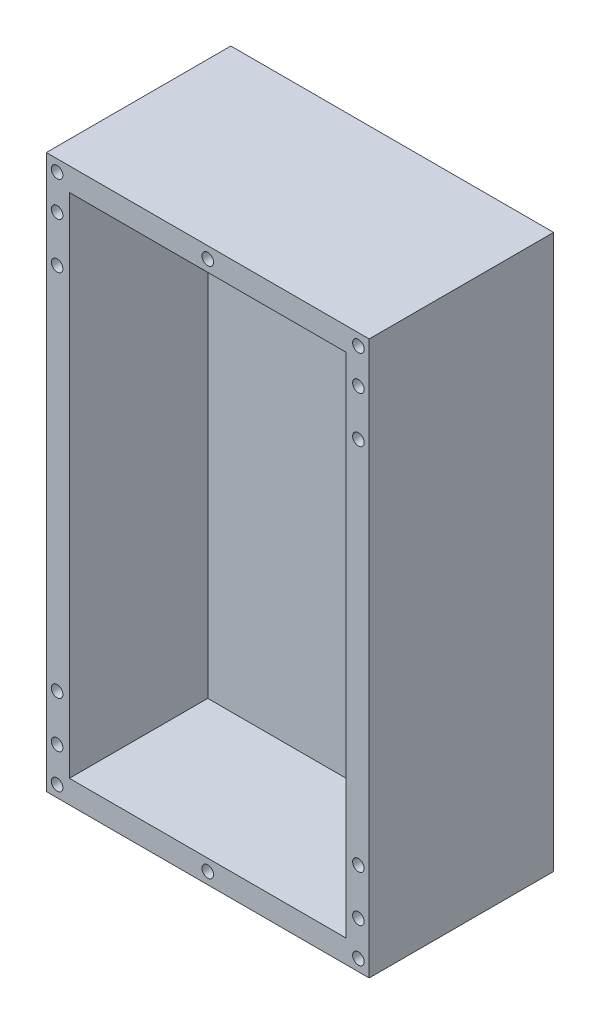
ISO-10303-21;
HEADER;
FILE_DESCRIPTION(('STEP AP214'),'2;1');
FILE_NAME('part.step','',(''),(''),'','','');
FILE_SCHEMA(('AUTOMOTIVE_DESIGN { 1 0 10303 214 1 1 1 1 }'));
ENDSEC;
DATA;
#1=APPLICATION_CONTEXT('core data for automotive mechanical design processes');
#2=APPLICATION_PROTOCOL_DEFINITION('international standard','automotive_design',2000,#1);
#3=PRODUCT_CONTEXT('',#1,'mechanical');
#4=PRODUCT('Part','Part','',(#3));
#5=PRODUCT_RELATED_PRODUCT_CATEGORY('part','',(#4));
#6=PRODUCT_DEFINITION_FORMATION('','',#4);
#7=PRODUCT_DEFINITION_CONTEXT('part definition',#1,'design');
#8=PRODUCT_DEFINITION('design','',#6,#7);
#9=PRODUCT_DEFINITION_SHAPE('','',#8);
#10=(LENGTH_UNIT() NAMED_UNIT(*) SI_UNIT(.MILLI.,.METRE.));
#11=(NAMED_UNIT(*) PLANE_ANGLE_UNIT() SI_UNIT($,.RADIAN.));
#12=(NAMED_UNIT(*) SI_UNIT($,.STERADIAN.) SOLID_ANGLE_UNIT());
#13=UNCERTAINTY_MEASURE_WITH_UNIT(LENGTH_MEASURE(1.E-05),#10,'distance_accuracy_value','');
#14=(GEOMETRIC_REPRESENTATION_CONTEXT(3) GLOBAL_UNCERTAINTY_ASSIGNED_CONTEXT((#13)) GLOBAL_UNIT_ASSIGNED_CONTEXT((#10,
#11,#12)) REPRESENTATION_CONTEXT('',''));
#15=CARTESIAN_POINT('',(0.,0.,0.));
#16=DIRECTION('',(0.,0.,1.));
#17=DIRECTION('',(1.,0.,0.));
#18=AXIS2_PLACEMENT_3D('',#15,#16,#17);
#19=CARTESIAN_POINT('',(25.4,584.2,203.2));
#20=DIRECTION('',(1.,0.,0.));
#21=DIRECTION('',(0.,1.,0.));
#22=AXIS2_PLACEMENT_3D('',#19,#20,#21);
#23=PLANE('',#22);
#24=DIRECTION('',(0.,0.,-1.));
#25=VECTOR('',#24,1.);
#26=CARTESIAN_POINT('',(25.4,25.4000000000001,203.2));
#27=LINE('',#26,#25);
#28=CARTESIAN_POINT('',(25.4,25.4000000000001,203.2));
#29=VERTEX_POINT('',#28);
#30=CARTESIAN_POINT('',(25.4,25.4000000000001,50.8));
#31=VERTEX_POINT('',#30);
#32=EDGE_CURVE('E114',#29,#31,#27,.T.);
#33=ORIENTED_EDGE('',*,*,#32,.T.);
#34=DIRECTION('',(0.,1.,0.));
#35=VECTOR('',#34,1.);
#36=CARTESIAN_POINT('',(25.4,584.2,50.8));
#37=LINE('',#36,#35);
#38=CARTESIAN_POINT('',(25.4,584.2,50.8));
#39=VERTEX_POINT('',#38);
#40=EDGE_CURVE('E98',#31,#39,#37,.T.);
#41=ORIENTED_EDGE('',*,*,#40,.T.);
#42=DIRECTION('',(0.,0.,-1.));
#43=VECTOR('',#42,1.);
#44=CARTESIAN_POINT('',(25.4,584.2,203.2));
#45=LINE('',#44,#43);
#46=CARTESIAN_POINT('',(25.4,584.2,203.2));
#47=VERTEX_POINT('',#46);
#48=EDGE_CURVE('E118',#47,#39,#45,.T.);
#49=ORIENTED_EDGE('',*,*,#48,.F.);
#50=DIRECTION('',(0.,-1.,0.));
#51=VECTOR('',#50,1.);
#52=CARTESIAN_POINT('',(25.4,584.2,203.2));
#53=LINE('',#52,#51);
#54=EDGE_CURVE('E623',#47,#29,#53,.T.);
#55=ORIENTED_EDGE('',*,*,#54,.T.);
#56=EDGE_LOOP('',(#33,#41,#49,#55));
#57=FACE_BOUND('',#56,.T.);
#58=ADVANCED_FACE('F32',(#57),#23,.T.);
#59=CARTESIAN_POINT('',(25.4,25.4000000000001,203.2));
#60=DIRECTION('',(0.,1.,0.));
#61=DIRECTION('',(0.,0.,1.));
#62=AXIS2_PLACEMENT_3D('',#59,#60,#61);
#63=PLANE('',#62);
#64=DIRECTION('',(0.,0.,-1.));
#65=VECTOR('',#64,1.);
#66=CARTESIAN_POINT('',(330.2,25.4000000000001,203.2));
#67=LINE('',#66,#65);
#68=CARTESIAN_POINT('',(330.2,25.4000000000001,203.2));
#69=VERTEX_POINT('',#68);
#70=CARTESIAN_POINT('',(330.2,25.4000000000001,50.8));
#71=VERTEX_POINT('',#70);
#72=EDGE_CURVE('E107',#69,#71,#67,.T.);
#73=ORIENTED_EDGE('',*,*,#72,.T.);
#74=DIRECTION('',(-1.,0.,0.));
#75=VECTOR('',#74,1.);
#76=CARTESIAN_POINT('',(330.2,25.4000000000001,50.8));
#77=LINE('',#76,#75);
#78=EDGE_CURVE('E95',#71,#31,#77,.T.);
#79=ORIENTED_EDGE('',*,*,#78,.T.);
#80=ORIENTED_EDGE('',*,*,#32,.F.);
#81=DIRECTION('',(1.,0.,0.));
#82=VECTOR('',#81,1.);
#83=CARTESIAN_POINT('',(25.4,25.4000000000001,203.2));
#84=LINE('',#83,#82);
#85=EDGE_CURVE('E113',#29,#69,#84,.T.);
#86=ORIENTED_EDGE('',*,*,#85,.T.);
#87=EDGE_LOOP('',(#73,#79,#80,#86));
#88=FACE_BOUND('',#87,.T.);
#89=ADVANCED_FACE('F111',(#88),#63,.T.);
#90=CARTESIAN_POINT('',(330.2,584.2,203.2));
#91=DIRECTION('',(-1.,0.,0.));
#92=DIRECTION('',(0.,-1.,0.));
#93=AXIS2_PLACEMENT_3D('',#90,#91,#92);
#94=PLANE('',#93);
#95=DIRECTION('',(0.,0.,-1.));
#96=VECTOR('',#95,1.);
#97=CARTESIAN_POINT('',(330.2,584.2,203.2));
#98=LINE('',#97,#96);
#99=CARTESIAN_POINT('',(330.2,584.2,203.2));
#100=VERTEX_POINT('',#99);
#101=CARTESIAN_POINT('',(330.2,584.2,50.8));
#102=VERTEX_POINT('',#101);
#103=EDGE_CURVE('E54',#100,#102,#98,.T.);
#104=ORIENTED_EDGE('',*,*,#103,.T.);
#105=DIRECTION('',(0.,-1.,0.));
#106=VECTOR('',#105,1.);
#107=CARTESIAN_POINT('',(330.2,584.2,50.8));
#108=LINE('',#107,#106);
#109=EDGE_CURVE('E47',#102,#71,#108,.T.);
#110=ORIENTED_EDGE('',*,*,#109,.T.);
#111=ORIENTED_EDGE('',*,*,#72,.F.);
#112=DIRECTION('',(0.,1.,0.));
#113=VECTOR('',#112,1.);
#114=CARTESIAN_POINT('',(330.2,584.2,203.2));
#115=LINE('',#114,#113);
#116=EDGE_CURVE('E626',#69,#100,#115,.T.);
#117=ORIENTED_EDGE('',*,*,#116,.T.);
#118=EDGE_LOOP('',(#104,#110,#111,#117));
#119=FACE_BOUND('',#118,.T.);
#120=ADVANCED_FACE('F106',(#119),#94,.T.);
#121=CARTESIAN_POINT('',(25.4,584.2,203.2));
#122=DIRECTION('',(0.,-1.,0.));
#123=DIRECTION('',(0.,0.,-1.));
#124=AXIS2_PLACEMENT_3D('',#121,#122,#123);
#125=PLANE('',#124);
#126=ORIENTED_EDGE('',*,*,#48,.T.);
#127=DIRECTION('',(1.,0.,0.));
#128=VECTOR('',#127,1.);
#129=CARTESIAN_POINT('',(330.2,584.2,50.8));
#130=LINE('',#129,#128);
#131=EDGE_CURVE('E621',#39,#102,#130,.T.);
#132=ORIENTED_EDGE('',*,*,#131,.T.);
#133=ORIENTED_EDGE('',*,*,#103,.F.);
#134=DIRECTION('',(-1.,0.,0.));
#135=VECTOR('',#134,1.);
#136=CARTESIAN_POINT('',(25.4,584.2,203.2));
#137=LINE('',#136,#135);
#138=EDGE_CURVE('E628',#100,#47,#137,.T.);
#139=ORIENTED_EDGE('',*,*,#138,.T.);
#140=EDGE_LOOP('',(#126,#132,#133,#139));
#141=FACE_BOUND('',#140,.T.);
#142=ADVANCED_FACE('F184',(#141),#125,.T.);
#143=CARTESIAN_POINT('',(0.,0.,203.2));
#144=DIRECTION('',(0.,0.,1.));
#145=DIRECTION('',(1.,0.,0.));
#146=AXIS2_PLACEMENT_3D('',#143,#144,#145);
#147=PLANE('',#146);
#148=CARTESIAN_POINT('',(177.8,596.9,203.2));
#149=DIRECTION('',(0.,0.,1.));
#150=DIRECTION('',(1.,0.,0.));
#151=AXIS2_PLACEMENT_3D('',#148,#149,#150);
#152=CIRCLE('',#151,6.34999999999999);
#153=CARTESIAN_POINT('',(184.15,596.9,203.2));
#154=VERTEX_POINT('',#153);
#155=EDGE_CURVE('E541',#154,#154,#152,.T.);
#156=ORIENTED_EDGE('',*,*,#155,.F.);
#157=EDGE_LOOP('',(#156));
#158=FACE_BOUND('',#157,.T.);
#159=CARTESIAN_POINT('',(11.8856741400404,596.9,203.2));
#160=DIRECTION('',(0.,0.,1.));
#161=DIRECTION('',(1.,0.,0.));
#162=AXIS2_PLACEMENT_3D('',#159,#160,#161);
#163=CIRCLE('',#162,6.35000000000002);
#164=CARTESIAN_POINT('',(18.2356741400405,596.9,203.2));
#165=VERTEX_POINT('',#164);
#166=EDGE_CURVE('E555',#165,#165,#163,.T.);
#167=ORIENTED_EDGE('',*,*,#166,.F.);
#168=EDGE_LOOP('',(#167));
#169=FACE_BOUND('',#168,.T.);
#170=CARTESIAN_POINT('',(343.71432585996,12.6999999999999,203.2));
#171=DIRECTION('',(0.,0.,1.));
#172=DIRECTION('',(-1.,0.,0.));
#173=AXIS2_PLACEMENT_3D('',#170,#171,#172);
#174=CIRCLE('',#173,6.34999999999999);
#175=CARTESIAN_POINT('',(337.36432585996,12.6999999999999,203.2));
#176=VERTEX_POINT('',#175);
#177=EDGE_CURVE('E561',#176,#176,#174,.T.);
#178=ORIENTED_EDGE('',*,*,#177,.F.);
#179=EDGE_LOOP('',(#178));
#180=FACE_BOUND('',#179,.T.);
#181=CARTESIAN_POINT('',(177.8,12.7000000000003,203.2));
#182=DIRECTION('',(0.,0.,1.));
#183=DIRECTION('',(-1.,0.,0.));
#184=AXIS2_PLACEMENT_3D('',#181,#182,#183);
#185=CIRCLE('',#184,6.34999999999999);
#186=CARTESIAN_POINT('',(171.45,12.7000000000003,203.2));
#187=VERTEX_POINT('',#186);
#188=EDGE_CURVE('E567',#187,#187,#185,.T.);
#189=ORIENTED_EDGE('',*,*,#188,.F.);
#190=EDGE_LOOP('',(#189));
#191=FACE_BOUND('',#190,.T.);
#192=CARTESIAN_POINT('',(11.8856741400404,12.7000000000003,203.2));
#193=DIRECTION('',(0.,0.,1.));
#194=DIRECTION('',(-1.,0.,0.));
#195=AXIS2_PLACEMENT_3D('',#192,#193,#194);
#196=CIRCLE('',#195,6.35000000000002);
#197=CARTESIAN_POINT('',(5.53567414004041,12.7000000000003,203.2));
#198=VERTEX_POINT('',#197);
#199=EDGE_CURVE('E550',#198,#198,#196,.T.);
#200=ORIENTED_EDGE('',*,*,#199,.F.);
#201=EDGE_LOOP('',(#200));
#202=FACE_BOUND('',#201,.T.);
#203=CARTESIAN_POINT('',(343.71432585996,596.9,203.2));
#204=DIRECTION('',(0.,0.,1.));
#205=DIRECTION('',(1.,0.,0.));
#206=AXIS2_PLACEMENT_3D('',#203,#204,#205);
#207=CIRCLE('',#206,6.34999999999999);
#208=CARTESIAN_POINT('',(350.06432585996,596.9,203.2));
#209=VERTEX_POINT('',#208);
#210=EDGE_CURVE('E540',#209,#209,#207,.T.);
#211=ORIENTED_EDGE('',*,*,#210,.F.);
#212=EDGE_LOOP('',(#211));
#213=FACE_BOUND('',#212,.T.);
#214=CARTESIAN_POINT('',(343.71432585996,50.9473532463124,203.2));
#215=DIRECTION('',(0.,0.,1.));
#216=DIRECTION('',(-1.,0.,0.));
#217=AXIS2_PLACEMENT_3D('',#214,#215,#216);
#218=CIRCLE('',#217,6.35);
#219=CARTESIAN_POINT('',(337.36432585996,50.9473532463124,203.2));
#220=VERTEX_POINT('',#219);
#221=EDGE_CURVE('E583',#220,#220,#218,.T.);
#222=ORIENTED_EDGE('',*,*,#221,.F.);
#223=EDGE_LOOP('',(#222));
#224=FACE_BOUND('',#223,.T.);
#225=CARTESIAN_POINT('',(11.8856741400404,558.652646753688,203.2));
#226=DIRECTION('',(0.,0.,1.));
#227=DIRECTION('',(-1.,0.,0.));
#228=AXIS2_PLACEMENT_3D('',#225,#226,#227);
#229=CIRCLE('',#228,6.35);
#230=CARTESIAN_POINT('',(5.53567414004044,558.652646753688,203.2));
#231=VERTEX_POINT('',#230);
#232=EDGE_CURVE('E596',#231,#231,#229,.T.);
#233=ORIENTED_EDGE('',*,*,#232,.F.);
#234=EDGE_LOOP('',(#233));
#235=FACE_BOUND('',#234,.T.);
#236=CARTESIAN_POINT('',(11.8856741400404,507.852646753687,203.2));
#237=DIRECTION('',(0.,0.,1.));
#238=DIRECTION('',(-1.,0.,0.));
#239=AXIS2_PLACEMENT_3D('',#236,#237,#238);
#240=CIRCLE('',#239,6.35);
#241=CARTESIAN_POINT('',(5.53567414004044,507.852646753687,203.2));
#242=VERTEX_POINT('',#241);
#243=EDGE_CURVE('E595',#242,#242,#240,.T.);
#244=ORIENTED_EDGE('',*,*,#243,.F.);
#245=EDGE_LOOP('',(#244));
#246=FACE_BOUND('',#245,.T.);
#247=CARTESIAN_POINT('',(11.8856741400404,101.747353246312,203.2));
#248=DIRECTION('',(0.,0.,1.));
#249=DIRECTION('',(1.,0.,0.));
#250=AXIS2_PLACEMENT_3D('',#247,#248,#249);
#251=CIRCLE('',#250,6.35);
#252=CARTESIAN_POINT('',(18.2356741400404,101.747353246312,203.2));
#253=VERTEX_POINT('',#252);
#254=EDGE_CURVE('E608',#253,#253,#251,.T.);
#255=ORIENTED_EDGE('',*,*,#254,.F.);
#256=EDGE_LOOP('',(#255));
#257=FACE_BOUND('',#256,.T.);
#258=CARTESIAN_POINT('',(343.71432585996,507.852646753687,203.2));
#259=DIRECTION('',(0.,0.,1.));
#260=DIRECTION('',(1.,0.,0.));
#261=AXIS2_PLACEMENT_3D('',#258,#259,#260);
#262=CIRCLE('',#261,6.34999999999999);
#263=CARTESIAN_POINT('',(350.06432585996,507.852646753687,203.2));
#264=VERTEX_POINT('',#263);
#265=EDGE_CURVE('E572',#264,#264,#262,.T.);
#266=ORIENTED_EDGE('',*,*,#265,.F.);
#267=EDGE_LOOP('',(#266));
#268=FACE_BOUND('',#267,.T.);
#269=CARTESIAN_POINT('',(343.71432585996,558.652646753687,203.2));
#270=DIRECTION('',(0.,0.,1.));
#271=DIRECTION('',(1.,0.,0.));
#272=AXIS2_PLACEMENT_3D('',#269,#270,#271);
#273=CIRCLE('',#272,6.34999999999999);
#274=CARTESIAN_POINT('',(350.06432585996,558.652646753687,203.2));
#275=VERTEX_POINT('',#274);
#276=EDGE_CURVE('E577',#275,#275,#273,.T.);
#277=ORIENTED_EDGE('',*,*,#276,.F.);
#278=EDGE_LOOP('',(#277));
#279=FACE_BOUND('',#278,.T.);
#280=CARTESIAN_POINT('',(343.71432585996,101.747353246312,203.2));
#281=DIRECTION('',(0.,0.,1.));
#282=DIRECTION('',(-1.,0.,0.));
#283=AXIS2_PLACEMENT_3D('',#280,#281,#282);
#284=CIRCLE('',#283,6.34999999999999);
#285=CARTESIAN_POINT('',(337.36432585996,101.747353246312,203.2));
#286=VERTEX_POINT('',#285);
#287=EDGE_CURVE('E584',#286,#286,#284,.T.);
#288=ORIENTED_EDGE('',*,*,#287,.F.);
#289=EDGE_LOOP('',(#288));
#290=FACE_BOUND('',#289,.T.);
#291=CARTESIAN_POINT('',(11.8856741400404,50.9473532463124,203.2));
#292=DIRECTION('',(0.,0.,1.));
#293=DIRECTION('',(1.,0.,0.));
#294=AXIS2_PLACEMENT_3D('',#291,#292,#293);
#295=CIRCLE('',#294,6.35);
#296=CARTESIAN_POINT('',(18.2356741400404,50.9473532463124,203.2));
#297=VERTEX_POINT('',#296);
#298=EDGE_CURVE('E607',#297,#297,#295,.T.);
#299=ORIENTED_EDGE('',*,*,#298,.F.);
#300=EDGE_LOOP('',(#299));
#301=FACE_BOUND('',#300,.T.);
#302=DIRECTION('',(0.,-1.,0.));
#303=VECTOR('',#302,1.);
#304=CARTESIAN_POINT('',(0.,609.6,203.2));
#305=LINE('',#304,#303);
#306=CARTESIAN_POINT('',(0.,609.6,203.2));
#307=VERTEX_POINT('',#306);
#308=CARTESIAN_POINT('',(0.,0.,203.2));
#309=VERTEX_POINT('',#308);
#310=EDGE_CURVE('E122',#307,#309,#305,.T.);
#311=ORIENTED_EDGE('',*,*,#310,.T.);
#312=DIRECTION('',(1.,0.,0.));
#313=VECTOR('',#312,1.);
#314=CARTESIAN_POINT('',(0.,0.,203.2));
#315=LINE('',#314,#313);
#316=CARTESIAN_POINT('',(355.6,0.,203.2));
#317=VERTEX_POINT('',#316);
#318=EDGE_CURVE('E125',#309,#317,#315,.T.);
#319=ORIENTED_EDGE('',*,*,#318,.T.);
#320=DIRECTION('',(0.,1.,0.));
#321=VECTOR('',#320,1.);
#322=CARTESIAN_POINT('',(355.6,609.6,203.2));
#323=LINE('',#322,#321);
#324=CARTESIAN_POINT('',(355.6,609.6,203.2));
#325=VERTEX_POINT('',#324);
#326=EDGE_CURVE('E128',#317,#325,#323,.T.);
#327=ORIENTED_EDGE('',*,*,#326,.T.);
#328=DIRECTION('',(-1.,0.,0.));
#329=VECTOR('',#328,1.);
#330=CARTESIAN_POINT('',(0.,609.6,203.2));
#331=LINE('',#330,#329);
#332=EDGE_CURVE('E130',#325,#307,#331,.T.);
#333=ORIENTED_EDGE('',*,*,#332,.T.);
#334=EDGE_LOOP('',(#311,#319,#327,#333));
#335=FACE_BOUND('',#334,.T.);
#336=ORIENTED_EDGE('',*,*,#85,.F.);
#337=ORIENTED_EDGE('',*,*,#54,.F.);
#338=ORIENTED_EDGE('',*,*,#138,.F.);
#339=ORIENTED_EDGE('',*,*,#116,.F.);
#340=EDGE_LOOP('',(#336,#337,#338,#339));
#341=FACE_BOUND('',#340,.T.);
#342=ADVANCED_FACE('F164',(#158,#169,#180,#191,#202,#213,#224,#235,#246,#257,#268,#279,#290,
#301,#335,#341),#147,.T.);
#343=CARTESIAN_POINT('',(0.,0.,0.));
#344=DIRECTION('',(0.,0.,1.));
#345=DIRECTION('',(1.,0.,0.));
#346=AXIS2_PLACEMENT_3D('',#343,#344,#345);
#347=PLANE('',#346);
#348=DIRECTION('',(0.,-1.,0.));
#349=VECTOR('',#348,1.);
#350=CARTESIAN_POINT('',(0.,609.6,0.));
#351=LINE('',#350,#349);
#352=CARTESIAN_POINT('',(0.,609.6,0.));
#353=VERTEX_POINT('',#352);
#354=CARTESIAN_POINT('',(0.,0.,0.));
#355=VERTEX_POINT('',#354);
#356=EDGE_CURVE('E116',#353,#355,#351,.T.);
#357=ORIENTED_EDGE('',*,*,#356,.F.);
#358=DIRECTION('',(-1.,0.,0.));
#359=VECTOR('',#358,1.);
#360=CARTESIAN_POINT('',(0.,609.6,0.));
#361=LINE('',#360,#359);
#362=CARTESIAN_POINT('',(355.6,609.6,0.));
#363=VERTEX_POINT('',#362);
#364=EDGE_CURVE('E126',#363,#353,#361,.T.);
#365=ORIENTED_EDGE('',*,*,#364,.F.);
#366=DIRECTION('',(0.,1.,0.));
#367=VECTOR('',#366,1.);
#368=CARTESIAN_POINT('',(355.6,609.6,0.));
#369=LINE('',#368,#367);
#370=CARTESIAN_POINT('',(355.6,0.,0.));
#371=VERTEX_POINT('',#370);
#372=EDGE_CURVE('E137',#371,#363,#369,.T.);
#373=ORIENTED_EDGE('',*,*,#372,.F.);
#374=DIRECTION('',(1.,0.,0.));
#375=VECTOR('',#374,1.);
#376=CARTESIAN_POINT('',(0.,0.,0.));
#377=LINE('',#376,#375);
#378=EDGE_CURVE('E135',#355,#371,#377,.T.);
#379=ORIENTED_EDGE('',*,*,#378,.F.);
#380=EDGE_LOOP('',(#357,#365,#373,#379));
#381=FACE_BOUND('',#380,.T.);
#382=ADVANCED_FACE('F155',(#381),#347,.F.);
#383=CARTESIAN_POINT('',(0.,609.6,203.2));
#384=DIRECTION('',(1.,0.,0.));
#385=DIRECTION('',(0.,1.,0.));
#386=AXIS2_PLACEMENT_3D('',#383,#384,#385);
#387=PLANE('',#386);
#388=ORIENTED_EDGE('',*,*,#356,.T.);
#389=DIRECTION('',(0.,0.,-1.));
#390=VECTOR('',#389,1.);
#391=CARTESIAN_POINT('',(0.,0.,203.2));
#392=LINE('',#391,#390);
#393=EDGE_CURVE('E11',#309,#355,#392,.T.);
#394=ORIENTED_EDGE('',*,*,#393,.F.);
#395=ORIENTED_EDGE('',*,*,#310,.F.);
#396=DIRECTION('',(0.,0.,-1.));
#397=VECTOR('',#396,1.);
#398=CARTESIAN_POINT('',(0.,609.6,203.2));
#399=LINE('',#398,#397);
#400=EDGE_CURVE('E132',#307,#353,#399,.T.);
#401=ORIENTED_EDGE('',*,*,#400,.T.);
#402=EDGE_LOOP('',(#388,#394,#395,#401));
#403=FACE_BOUND('',#402,.T.);
#404=ADVANCED_FACE('F34',(#403),#387,.F.);
#405=CARTESIAN_POINT('',(0.,0.,203.2));
#406=DIRECTION('',(0.,1.,0.));
#407=DIRECTION('',(0.,0.,1.));
#408=AXIS2_PLACEMENT_3D('',#405,#406,#407);
#409=PLANE('',#408);
#410=ORIENTED_EDGE('',*,*,#378,.T.);
#411=DIRECTION('',(0.,0.,-1.));
#412=VECTOR('',#411,1.);
#413=CARTESIAN_POINT('',(355.6,0.,203.2));
#414=LINE('',#413,#412);
#415=EDGE_CURVE('E40',#317,#371,#414,.T.);
#416=ORIENTED_EDGE('',*,*,#415,.F.);
#417=ORIENTED_EDGE('',*,*,#318,.F.);
#418=ORIENTED_EDGE('',*,*,#393,.T.);
#419=EDGE_LOOP('',(#410,#416,#417,#418));
#420=FACE_BOUND('',#419,.T.);
#421=ADVANCED_FACE('F166',(#420),#409,.F.);
#422=CARTESIAN_POINT('',(355.6,609.6,203.2));
#423=DIRECTION('',(-1.,0.,0.));
#424=DIRECTION('',(0.,-1.,0.));
#425=AXIS2_PLACEMENT_3D('',#422,#423,#424);
#426=PLANE('',#425);
#427=ORIENTED_EDGE('',*,*,#372,.T.);
#428=DIRECTION('',(0.,0.,-1.));
#429=VECTOR('',#428,1.);
#430=CARTESIAN_POINT('',(355.6,609.6,203.2));
#431=LINE('',#430,#429);
#432=EDGE_CURVE('E142',#325,#363,#431,.T.);
#433=ORIENTED_EDGE('',*,*,#432,.F.);
#434=ORIENTED_EDGE('',*,*,#326,.F.);
#435=ORIENTED_EDGE('',*,*,#415,.T.);
#436=EDGE_LOOP('',(#427,#433,#434,#435));
#437=FACE_BOUND('',#436,.T.);
#438=ADVANCED_FACE('F149',(#437),#426,.F.);
#439=CARTESIAN_POINT('',(0.,609.6,203.2));
#440=DIRECTION('',(0.,-1.,0.));
#441=DIRECTION('',(0.,0.,-1.));
#442=AXIS2_PLACEMENT_3D('',#439,#440,#441);
#443=PLANE('',#442);
#444=ORIENTED_EDGE('',*,*,#364,.T.);
#445=ORIENTED_EDGE('',*,*,#400,.F.);
#446=ORIENTED_EDGE('',*,*,#332,.F.);
#447=ORIENTED_EDGE('',*,*,#432,.T.);
#448=EDGE_LOOP('',(#444,#445,#446,#447));
#449=FACE_BOUND('',#448,.T.);
#450=ADVANCED_FACE('F158',(#449),#443,.F.);
#451=CARTESIAN_POINT('',(0.,0.,50.8));
#452=DIRECTION('',(0.,0.,-1.));
#453=DIRECTION('',(-1.,0.,0.));
#454=AXIS2_PLACEMENT_3D('',#451,#452,#453);
#455=PLANE('',#454);
#456=ORIENTED_EDGE('',*,*,#109,.F.);
#457=ORIENTED_EDGE('',*,*,#131,.F.);
#458=ORIENTED_EDGE('',*,*,#40,.F.);
#459=ORIENTED_EDGE('',*,*,#78,.F.);
#460=EDGE_LOOP('',(#456,#457,#458,#459));
#461=FACE_BOUND('',#460,.T.);
#462=ADVANCED_FACE('F96',(#461),#455,.F.);
#463=CARTESIAN_POINT('',(11.8856741400404,50.9473532463124,177.8));
#464=DIRECTION('',(0.,0.,1.));
#465=DIRECTION('',(1.,0.,0.));
#466=AXIS2_PLACEMENT_3D('',#463,#464,#465);
#467=CYLINDRICAL_SURFACE('',#466,6.35);
#468=CARTESIAN_POINT('',(11.8856741400404,50.9473532463124,177.8));
#469=DIRECTION('',(0.,0.,1.));
#470=DIRECTION('',(1.,0.,0.));
#471=AXIS2_PLACEMENT_3D('',#468,#469,#470);
#472=CIRCLE('',#471,6.35);
#473=CARTESIAN_POINT('',(18.2356741400404,50.9473532463124,177.8));
#474=VERTEX_POINT('',#473);
#475=EDGE_CURVE('E109',#474,#474,#472,.T.);
#476=ORIENTED_EDGE('',*,*,#475,.F.);
#477=EDGE_LOOP('',(#476));
#478=FACE_BOUND('',#477,.T.);
#479=ORIENTED_EDGE('',*,*,#298,.T.);
#480=EDGE_LOOP('',(#479));
#481=FACE_BOUND('',#480,.T.);
#482=ADVANCED_FACE('F192',(#478,#481),#467,.F.);
#483=CARTESIAN_POINT('',(11.8856741400404,50.9473532463124,177.8));
#484=DIRECTION('',(0.,0.,1.));
#485=DIRECTION('',(1.,0.,0.));
#486=AXIS2_PLACEMENT_3D('',#483,#484,#485);
#487=PLANE('',#486);
#488=ORIENTED_EDGE('',*,*,#475,.T.);
#489=EDGE_LOOP('',(#488));
#490=FACE_BOUND('',#489,.T.);
#491=ADVANCED_FACE('F197',(#490),#487,.T.);
#492=CARTESIAN_POINT('',(343.71432585996,101.747353246312,177.8));
#493=DIRECTION('',(0.,0.,1.));
#494=DIRECTION('',(1.,0.,0.));
#495=AXIS2_PLACEMENT_3D('',#492,#493,#494);
#496=CYLINDRICAL_SURFACE('',#495,6.34999999999999);
#497=CARTESIAN_POINT('',(343.71432585996,101.747353246312,177.8));
#498=DIRECTION('',(0.,0.,1.));
#499=DIRECTION('',(-1.,0.,0.));
#500=AXIS2_PLACEMENT_3D('',#497,#498,#499);
#501=CIRCLE('',#500,6.34999999999999);
#502=CARTESIAN_POINT('',(337.36432585996,101.747353246312,177.8));
#503=VERTEX_POINT('',#502);
#504=EDGE_CURVE('E580',#503,#503,#501,.T.);
#505=ORIENTED_EDGE('',*,*,#504,.F.);
#506=EDGE_LOOP('',(#505));
#507=FACE_BOUND('',#506,.T.);
#508=ORIENTED_EDGE('',*,*,#287,.T.);
#509=EDGE_LOOP('',(#508));
#510=FACE_BOUND('',#509,.T.);
#511=ADVANCED_FACE('F276',(#507,#510),#496,.F.);
#512=CARTESIAN_POINT('',(343.71432585996,101.747353246312,177.8));
#513=DIRECTION('',(0.,0.,-1.));
#514=DIRECTION('',(-1.,0.,0.));
#515=AXIS2_PLACEMENT_3D('',#512,#513,#514);
#516=PLANE('',#515);
#517=ORIENTED_EDGE('',*,*,#504,.T.);
#518=EDGE_LOOP('',(#517));
#519=FACE_BOUND('',#518,.T.);
#520=ADVANCED_FACE('F284',(#519),#516,.F.);
#521=CARTESIAN_POINT('',(343.71432585996,558.652646753687,177.8));
#522=DIRECTION('',(0.,0.,1.));
#523=DIRECTION('',(1.,0.,0.));
#524=AXIS2_PLACEMENT_3D('',#521,#522,#523);
#525=CYLINDRICAL_SURFACE('',#524,6.34999999999999);
#526=CARTESIAN_POINT('',(343.71432585996,558.652646753687,177.8));
#527=DIRECTION('',(0.,0.,1.));
#528=DIRECTION('',(1.,0.,0.));
#529=AXIS2_PLACEMENT_3D('',#526,#527,#528);
#530=CIRCLE('',#529,6.34999999999999);
#531=CARTESIAN_POINT('',(350.06432585996,558.652646753687,177.8));
#532=VERTEX_POINT('',#531);
#533=EDGE_CURVE('E587',#532,#532,#530,.T.);
#534=ORIENTED_EDGE('',*,*,#533,.F.);
#535=EDGE_LOOP('',(#534));
#536=FACE_BOUND('',#535,.T.);
#537=ORIENTED_EDGE('',*,*,#276,.T.);
#538=EDGE_LOOP('',(#537));
#539=FACE_BOUND('',#538,.T.);
#540=ADVANCED_FACE('F293',(#536,#539),#525,.F.);
#541=CARTESIAN_POINT('',(343.71432585996,558.652646753687,177.8));
#542=DIRECTION('',(0.,0.,1.));
#543=DIRECTION('',(1.,0.,0.));
#544=AXIS2_PLACEMENT_3D('',#541,#542,#543);
#545=PLANE('',#544);
#546=ORIENTED_EDGE('',*,*,#533,.T.);
#547=EDGE_LOOP('',(#546));
#548=FACE_BOUND('',#547,.T.);
#549=ADVANCED_FACE('F302',(#548),#545,.T.);
#550=CARTESIAN_POINT('',(343.71432585996,507.852646753687,177.8));
#551=DIRECTION('',(0.,0.,1.));
#552=DIRECTION('',(1.,0.,0.));
#553=AXIS2_PLACEMENT_3D('',#550,#551,#552);
#554=CYLINDRICAL_SURFACE('',#553,6.34999999999999);
#555=CARTESIAN_POINT('',(343.71432585996,507.852646753687,177.8));
#556=DIRECTION('',(0.,0.,1.));
#557=DIRECTION('',(1.,0.,0.));
#558=AXIS2_PLACEMENT_3D('',#555,#556,#557);
#559=CIRCLE('',#558,6.34999999999999);
#560=CARTESIAN_POINT('',(350.06432585996,507.852646753687,177.8));
#561=VERTEX_POINT('',#560);
#562=EDGE_CURVE('E574',#561,#561,#559,.T.);
#563=ORIENTED_EDGE('',*,*,#562,.F.);
#564=EDGE_LOOP('',(#563));
#565=FACE_BOUND('',#564,.T.);
#566=ORIENTED_EDGE('',*,*,#265,.T.);
#567=EDGE_LOOP('',(#566));
#568=FACE_BOUND('',#567,.T.);
#569=ADVANCED_FACE('F311',(#565,#568),#554,.F.);
#570=CARTESIAN_POINT('',(343.71432585996,507.852646753687,177.8));
#571=DIRECTION('',(0.,0.,1.));
#572=DIRECTION('',(1.,0.,0.));
#573=AXIS2_PLACEMENT_3D('',#570,#571,#572);
#574=PLANE('',#573);
#575=ORIENTED_EDGE('',*,*,#562,.T.);
#576=EDGE_LOOP('',(#575));
#577=FACE_BOUND('',#576,.T.);
#578=ADVANCED_FACE('F320',(#577),#574,.T.);
#579=CARTESIAN_POINT('',(11.8856741400404,101.747353246312,177.8));
#580=DIRECTION('',(0.,0.,1.));
#581=DIRECTION('',(1.,0.,0.));
#582=AXIS2_PLACEMENT_3D('',#579,#580,#581);
#583=CYLINDRICAL_SURFACE('',#582,6.35);
#584=CARTESIAN_POINT('',(11.8856741400404,101.747353246312,177.8));
#585=DIRECTION('',(0.,0.,1.));
#586=DIRECTION('',(1.,0.,0.));
#587=AXIS2_PLACEMENT_3D('',#584,#585,#586);
#588=CIRCLE('',#587,6.35);
#589=CARTESIAN_POINT('',(18.2356741400404,101.747353246312,177.8));
#590=VERTEX_POINT('',#589);
#591=EDGE_CURVE('E604',#590,#590,#588,.T.);
#592=ORIENTED_EDGE('',*,*,#591,.F.);
#593=EDGE_LOOP('',(#592));
#594=FACE_BOUND('',#593,.T.);
#595=ORIENTED_EDGE('',*,*,#254,.T.);
#596=EDGE_LOOP('',(#595));
#597=FACE_BOUND('',#596,.T.);
#598=ADVANCED_FACE('F329',(#594,#597),#583,.F.);
#599=CARTESIAN_POINT('',(11.8856741400404,101.747353246312,177.8));
#600=DIRECTION('',(0.,0.,1.));
#601=DIRECTION('',(1.,0.,0.));
#602=AXIS2_PLACEMENT_3D('',#599,#600,#601);
#603=PLANE('',#602);
#604=ORIENTED_EDGE('',*,*,#591,.T.);
#605=EDGE_LOOP('',(#604));
#606=FACE_BOUND('',#605,.T.);
#607=ADVANCED_FACE('F338',(#606),#603,.T.);
#608=CARTESIAN_POINT('',(11.8856741400404,507.852646753687,177.8));
#609=DIRECTION('',(0.,0.,1.));
#610=DIRECTION('',(1.,0.,0.));
#611=AXIS2_PLACEMENT_3D('',#608,#609,#610);
#612=CYLINDRICAL_SURFACE('',#611,6.35);
#613=CARTESIAN_POINT('',(11.8856741400404,507.852646753687,177.8));
#614=DIRECTION('',(0.,0.,1.));
#615=DIRECTION('',(-1.,0.,0.));
#616=AXIS2_PLACEMENT_3D('',#613,#614,#615);
#617=CIRCLE('',#616,6.35);
#618=CARTESIAN_POINT('',(5.53567414004044,507.852646753687,177.8));
#619=VERTEX_POINT('',#618);
#620=EDGE_CURVE('E611',#619,#619,#617,.T.);
#621=ORIENTED_EDGE('',*,*,#620,.F.);
#622=EDGE_LOOP('',(#621));
#623=FACE_BOUND('',#622,.T.);
#624=ORIENTED_EDGE('',*,*,#243,.T.);
#625=EDGE_LOOP('',(#624));
#626=FACE_BOUND('',#625,.T.);
#627=ADVANCED_FACE('F347',(#623,#626),#612,.F.);
#628=CARTESIAN_POINT('',(11.8856741400404,507.852646753687,177.8));
#629=DIRECTION('',(0.,0.,-1.));
#630=DIRECTION('',(-1.,0.,0.));
#631=AXIS2_PLACEMENT_3D('',#628,#629,#630);
#632=PLANE('',#631);
#633=ORIENTED_EDGE('',*,*,#620,.T.);
#634=EDGE_LOOP('',(#633));
#635=FACE_BOUND('',#634,.T.);
#636=ADVANCED_FACE('F356',(#635),#632,.F.);
#637=CARTESIAN_POINT('',(11.8856741400404,558.652646753688,177.8));
#638=DIRECTION('',(0.,0.,1.));
#639=DIRECTION('',(1.,0.,0.));
#640=AXIS2_PLACEMENT_3D('',#637,#638,#639);
#641=CYLINDRICAL_SURFACE('',#640,6.35);
#642=CARTESIAN_POINT('',(11.8856741400404,558.652646753688,177.8));
#643=DIRECTION('',(0.,0.,1.));
#644=DIRECTION('',(-1.,0.,0.));
#645=AXIS2_PLACEMENT_3D('',#642,#643,#644);
#646=CIRCLE('',#645,6.35);
#647=CARTESIAN_POINT('',(5.53567414004044,558.652646753688,177.8));
#648=VERTEX_POINT('',#647);
#649=EDGE_CURVE('E592',#648,#648,#646,.T.);
#650=ORIENTED_EDGE('',*,*,#649,.F.);
#651=EDGE_LOOP('',(#650));
#652=FACE_BOUND('',#651,.T.);
#653=ORIENTED_EDGE('',*,*,#232,.T.);
#654=EDGE_LOOP('',(#653));
#655=FACE_BOUND('',#654,.T.);
#656=ADVANCED_FACE('F365',(#652,#655),#641,.F.);
#657=CARTESIAN_POINT('',(11.8856741400404,558.652646753688,177.8));
#658=DIRECTION('',(0.,0.,-1.));
#659=DIRECTION('',(-1.,0.,0.));
#660=AXIS2_PLACEMENT_3D('',#657,#658,#659);
#661=PLANE('',#660);
#662=ORIENTED_EDGE('',*,*,#649,.T.);
#663=EDGE_LOOP('',(#662));
#664=FACE_BOUND('',#663,.T.);
#665=ADVANCED_FACE('F374',(#664),#661,.F.);
#666=CARTESIAN_POINT('',(343.71432585996,50.9473532463124,177.8));
#667=DIRECTION('',(0.,0.,1.));
#668=DIRECTION('',(1.,0.,0.));
#669=AXIS2_PLACEMENT_3D('',#666,#667,#668);
#670=CYLINDRICAL_SURFACE('',#669,6.35);
#671=CARTESIAN_POINT('',(343.71432585996,50.9473532463124,177.8));
#672=DIRECTION('',(0.,0.,1.));
#673=DIRECTION('',(-1.,0.,0.));
#674=AXIS2_PLACEMENT_3D('',#671,#672,#673);
#675=CIRCLE('',#674,6.35);
#676=CARTESIAN_POINT('',(337.36432585996,50.9473532463124,177.8));
#677=VERTEX_POINT('',#676);
#678=EDGE_CURVE('E599',#677,#677,#675,.T.);
#679=ORIENTED_EDGE('',*,*,#678,.F.);
#680=EDGE_LOOP('',(#679));
#681=FACE_BOUND('',#680,.T.);
#682=ORIENTED_EDGE('',*,*,#221,.T.);
#683=EDGE_LOOP('',(#682));
#684=FACE_BOUND('',#683,.T.);
#685=ADVANCED_FACE('F383',(#681,#684),#670,.F.);
#686=CARTESIAN_POINT('',(343.71432585996,50.9473532463124,177.8));
#687=DIRECTION('',(0.,0.,-1.));
#688=DIRECTION('',(-1.,0.,0.));
#689=AXIS2_PLACEMENT_3D('',#686,#687,#688);
#690=PLANE('',#689);
#691=ORIENTED_EDGE('',*,*,#678,.T.);
#692=EDGE_LOOP('',(#691));
#693=FACE_BOUND('',#692,.T.);
#694=ADVANCED_FACE('F392',(#693),#690,.F.);
#695=CARTESIAN_POINT('',(343.71432585996,596.9,190.5));
#696=DIRECTION('',(0.,0.,1.));
#697=DIRECTION('',(1.,0.,0.));
#698=AXIS2_PLACEMENT_3D('',#695,#696,#697);
#699=CYLINDRICAL_SURFACE('',#698,6.34999999999999);
#700=CARTESIAN_POINT('',(343.71432585996,596.9,190.5));
#701=DIRECTION('',(0.,0.,1.));
#702=DIRECTION('',(1.,0.,0.));
#703=AXIS2_PLACEMENT_3D('',#700,#701,#702);
#704=CIRCLE('',#703,6.34999999999999);
#705=CARTESIAN_POINT('',(350.06432585996,596.9,190.5));
#706=VERTEX_POINT('',#705);
#707=EDGE_CURVE('E544',#706,#706,#704,.T.);
#708=ORIENTED_EDGE('',*,*,#707,.F.);
#709=EDGE_LOOP('',(#708));
#710=FACE_BOUND('',#709,.T.);
#711=ORIENTED_EDGE('',*,*,#210,.T.);
#712=EDGE_LOOP('',(#711));
#713=FACE_BOUND('',#712,.T.);
#714=ADVANCED_FACE('F400',(#710,#713),#699,.F.);
#715=CARTESIAN_POINT('',(343.71432585996,596.9,190.5));
#716=DIRECTION('',(0.,0.,1.));
#717=DIRECTION('',(1.,0.,0.));
#718=AXIS2_PLACEMENT_3D('',#715,#716,#717);
#719=PLANE('',#718);
#720=ORIENTED_EDGE('',*,*,#707,.T.);
#721=EDGE_LOOP('',(#720));
#722=FACE_BOUND('',#721,.T.);
#723=ADVANCED_FACE('F408',(#722),#719,.T.);
#724=CARTESIAN_POINT('',(11.8856741400404,12.7000000000003,190.5));
#725=DIRECTION('',(0.,0.,1.));
#726=DIRECTION('',(1.,0.,0.));
#727=AXIS2_PLACEMENT_3D('',#724,#725,#726);
#728=CYLINDRICAL_SURFACE('',#727,6.35000000000002);
#729=CARTESIAN_POINT('',(11.8856741400404,12.7000000000003,190.5));
#730=DIRECTION('',(0.,0.,1.));
#731=DIRECTION('',(-1.,0.,0.));
#732=AXIS2_PLACEMENT_3D('',#729,#730,#731);
#733=CIRCLE('',#732,6.35000000000002);
#734=CARTESIAN_POINT('',(5.53567414004041,12.7000000000003,190.5));
#735=VERTEX_POINT('',#734);
#736=EDGE_CURVE('E570',#735,#735,#733,.T.);
#737=ORIENTED_EDGE('',*,*,#736,.F.);
#738=EDGE_LOOP('',(#737));
#739=FACE_BOUND('',#738,.T.);
#740=ORIENTED_EDGE('',*,*,#199,.T.);
#741=EDGE_LOOP('',(#740));
#742=FACE_BOUND('',#741,.T.);
#743=ADVANCED_FACE('F417',(#739,#742),#728,.F.);
#744=CARTESIAN_POINT('',(11.8856741400404,12.7000000000003,190.5));
#745=DIRECTION('',(0.,0.,-1.));
#746=DIRECTION('',(-1.,0.,0.));
#747=AXIS2_PLACEMENT_3D('',#744,#745,#746);
#748=PLANE('',#747);
#749=ORIENTED_EDGE('',*,*,#736,.T.);
#750=EDGE_LOOP('',(#749));
#751=FACE_BOUND('',#750,.T.);
#752=ADVANCED_FACE('F426',(#751),#748,.F.);
#753=CARTESIAN_POINT('',(177.8,12.7000000000003,190.5));
#754=DIRECTION('',(0.,0.,1.));
#755=DIRECTION('',(1.,0.,0.));
#756=AXIS2_PLACEMENT_3D('',#753,#754,#755);
#757=CYLINDRICAL_SURFACE('',#756,6.34999999999999);
#758=CARTESIAN_POINT('',(177.8,12.7000000000003,190.5));
#759=DIRECTION('',(0.,0.,1.));
#760=DIRECTION('',(-1.,0.,0.));
#761=AXIS2_PLACEMENT_3D('',#758,#759,#760);
#762=CIRCLE('',#761,6.34999999999999);
#763=CARTESIAN_POINT('',(171.45,12.7000000000003,190.5));
#764=VERTEX_POINT('',#763);
#765=EDGE_CURVE('E564',#764,#764,#762,.T.);
#766=ORIENTED_EDGE('',*,*,#765,.F.);
#767=EDGE_LOOP('',(#766));
#768=FACE_BOUND('',#767,.T.);
#769=ORIENTED_EDGE('',*,*,#188,.T.);
#770=EDGE_LOOP('',(#769));
#771=FACE_BOUND('',#770,.T.);
#772=ADVANCED_FACE('F435',(#768,#771),#757,.F.);
#773=CARTESIAN_POINT('',(177.8,12.7000000000003,190.5));
#774=DIRECTION('',(0.,0.,-1.));
#775=DIRECTION('',(-1.,0.,0.));
#776=AXIS2_PLACEMENT_3D('',#773,#774,#775);
#777=PLANE('',#776);
#778=ORIENTED_EDGE('',*,*,#765,.T.);
#779=EDGE_LOOP('',(#778));
#780=FACE_BOUND('',#779,.T.);
#781=ADVANCED_FACE('F444',(#780),#777,.F.);
#782=CARTESIAN_POINT('',(343.71432585996,12.6999999999999,190.5));
#783=DIRECTION('',(0.,0.,1.));
#784=DIRECTION('',(1.,0.,0.));
#785=AXIS2_PLACEMENT_3D('',#782,#783,#784);
#786=CYLINDRICAL_SURFACE('',#785,6.34999999999999);
#787=CARTESIAN_POINT('',(343.71432585996,12.6999999999999,190.5));
#788=DIRECTION('',(0.,0.,1.));
#789=DIRECTION('',(-1.,0.,0.));
#790=AXIS2_PLACEMENT_3D('',#787,#788,#789);
#791=CIRCLE('',#790,6.34999999999999);
#792=CARTESIAN_POINT('',(337.36432585996,12.6999999999999,190.5));
#793=VERTEX_POINT('',#792);
#794=EDGE_CURVE('E558',#793,#793,#791,.T.);
#795=ORIENTED_EDGE('',*,*,#794,.F.);
#796=EDGE_LOOP('',(#795));
#797=FACE_BOUND('',#796,.T.);
#798=ORIENTED_EDGE('',*,*,#177,.T.);
#799=EDGE_LOOP('',(#798));
#800=FACE_BOUND('',#799,.T.);
#801=ADVANCED_FACE('F453',(#797,#800),#786,.F.);
#802=CARTESIAN_POINT('',(343.71432585996,12.6999999999999,190.5));
#803=DIRECTION('',(0.,0.,-1.));
#804=DIRECTION('',(-1.,0.,0.));
#805=AXIS2_PLACEMENT_3D('',#802,#803,#804);
#806=PLANE('',#805);
#807=ORIENTED_EDGE('',*,*,#794,.T.);
#808=EDGE_LOOP('',(#807));
#809=FACE_BOUND('',#808,.T.);
#810=ADVANCED_FACE('F462',(#809),#806,.F.);
#811=CARTESIAN_POINT('',(11.8856741400404,596.9,190.5));
#812=DIRECTION('',(0.,0.,1.));
#813=DIRECTION('',(1.,0.,0.));
#814=AXIS2_PLACEMENT_3D('',#811,#812,#813);
#815=CYLINDRICAL_SURFACE('',#814,6.35000000000002);
#816=CARTESIAN_POINT('',(11.8856741400404,596.9,190.5));
#817=DIRECTION('',(0.,0.,1.));
#818=DIRECTION('',(1.,0.,0.));
#819=AXIS2_PLACEMENT_3D('',#816,#817,#818);
#820=CIRCLE('',#819,6.35000000000002);
#821=CARTESIAN_POINT('',(18.2356741400405,596.9,190.5));
#822=VERTEX_POINT('',#821);
#823=EDGE_CURVE('E547',#822,#822,#820,.T.);
#824=ORIENTED_EDGE('',*,*,#823,.F.);
#825=EDGE_LOOP('',(#824));
#826=FACE_BOUND('',#825,.T.);
#827=ORIENTED_EDGE('',*,*,#166,.T.);
#828=EDGE_LOOP('',(#827));
#829=FACE_BOUND('',#828,.T.);
#830=ADVANCED_FACE('F471',(#826,#829),#815,.F.);
#831=CARTESIAN_POINT('',(11.8856741400404,596.9,190.5));
#832=DIRECTION('',(0.,0.,1.));
#833=DIRECTION('',(1.,0.,0.));
#834=AXIS2_PLACEMENT_3D('',#831,#832,#833);
#835=PLANE('',#834);
#836=ORIENTED_EDGE('',*,*,#823,.T.);
#837=EDGE_LOOP('',(#836));
#838=FACE_BOUND('',#837,.T.);
#839=ADVANCED_FACE('F480',(#838),#835,.T.);
#840=CARTESIAN_POINT('',(177.8,596.9,190.5));
#841=DIRECTION('',(0.,0.,1.));
#842=DIRECTION('',(1.,0.,0.));
#843=AXIS2_PLACEMENT_3D('',#840,#841,#842);
#844=CYLINDRICAL_SURFACE('',#843,6.34999999999999);
#845=CARTESIAN_POINT('',(177.8,596.9,190.5));
#846=DIRECTION('',(0.,0.,1.));
#847=DIRECTION('',(1.,0.,0.));
#848=AXIS2_PLACEMENT_3D('',#845,#846,#847);
#849=CIRCLE('',#848,6.34999999999999);
#850=CARTESIAN_POINT('',(184.15,596.9,190.5));
#851=VERTEX_POINT('',#850);
#852=EDGE_CURVE('E539',#851,#851,#849,.T.);
#853=ORIENTED_EDGE('',*,*,#852,.F.);
#854=EDGE_LOOP('',(#853));
#855=FACE_BOUND('',#854,.T.);
#856=ORIENTED_EDGE('',*,*,#155,.T.);
#857=EDGE_LOOP('',(#856));
#858=FACE_BOUND('',#857,.T.);
#859=ADVANCED_FACE('F489',(#855,#858),#844,.F.);
#860=CARTESIAN_POINT('',(177.8,596.9,190.5));
#861=DIRECTION('',(0.,0.,1.));
#862=DIRECTION('',(1.,0.,0.));
#863=AXIS2_PLACEMENT_3D('',#860,#861,#862);
#864=PLANE('',#863);
#865=ORIENTED_EDGE('',*,*,#852,.T.);
#866=EDGE_LOOP('',(#865));
#867=FACE_BOUND('',#866,.T.);
#868=ADVANCED_FACE('F498',(#867),#864,.T.);
#869=CLOSED_SHELL('',(#58,#89,#120,#142,#342,#382,#404,#421,#438,#450,#462,#482,#491,#511,#520,
#540,#549,#569,#578,#598,#607,#627,#636,#656,#665,#685,#694,#714,#723,#743,#752,#772,#781,#801,
#810,#830,#839,#859,#868));
#870=MANIFOLD_SOLID_BREP('B2',#869);
#871=ADVANCED_BREP_SHAPE_REPRESENTATION('',(#18,#870),#14);
#872=SHAPE_DEFINITION_REPRESENTATION(#9,#871);
ENDSEC;
END-ISO-10303-21;
